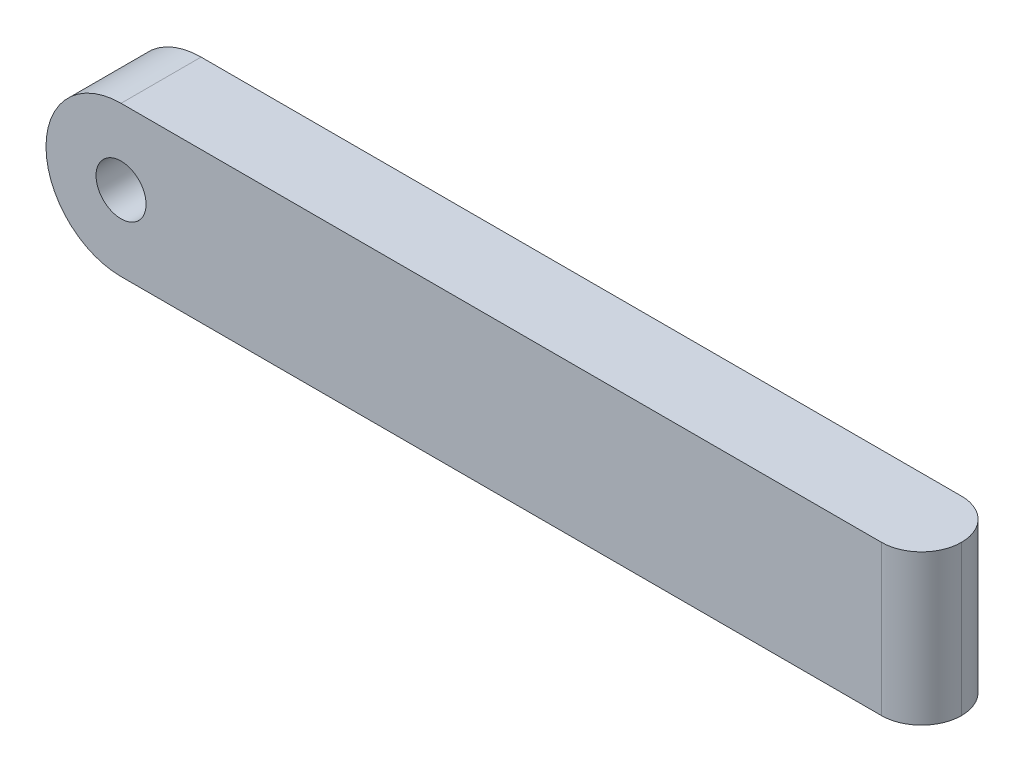
ISO-10303-21;
HEADER;
FILE_DESCRIPTION(('STEP AP214'),'2;1');
FILE_NAME('part.step','',(''),(''),'','','');
FILE_SCHEMA(('AUTOMOTIVE_DESIGN { 1 0 10303 214 1 1 1 1 }'));
ENDSEC;
DATA;
#1=APPLICATION_CONTEXT('core data for automotive mechanical design processes');
#2=APPLICATION_PROTOCOL_DEFINITION('international standard','automotive_design',2000,#1);
#3=PRODUCT_CONTEXT('',#1,'mechanical');
#4=PRODUCT('Part','Part','',(#3));
#5=PRODUCT_RELATED_PRODUCT_CATEGORY('part','',(#4));
#6=PRODUCT_DEFINITION_FORMATION('','',#4);
#7=PRODUCT_DEFINITION_CONTEXT('part definition',#1,'design');
#8=PRODUCT_DEFINITION('design','',#6,#7);
#9=PRODUCT_DEFINITION_SHAPE('','',#8);
#10=(LENGTH_UNIT() NAMED_UNIT(*) SI_UNIT(.MILLI.,.METRE.));
#11=(NAMED_UNIT(*) PLANE_ANGLE_UNIT() SI_UNIT($,.RADIAN.));
#12=(NAMED_UNIT(*) SI_UNIT($,.STERADIAN.) SOLID_ANGLE_UNIT());
#13=UNCERTAINTY_MEASURE_WITH_UNIT(LENGTH_MEASURE(1.E-05),#10,'distance_accuracy_value','');
#14=(GEOMETRIC_REPRESENTATION_CONTEXT(3) GLOBAL_UNCERTAINTY_ASSIGNED_CONTEXT((#13)) GLOBAL_UNIT_ASSIGNED_CONTEXT((#10,
#11,#12)) REPRESENTATION_CONTEXT('',''));
#15=CARTESIAN_POINT('',(0.,0.,0.));
#16=DIRECTION('',(0.,0.,1.));
#17=DIRECTION('',(1.,0.,0.));
#18=AXIS2_PLACEMENT_3D('',#15,#16,#17);
#19=CARTESIAN_POINT('',(0.,0.,8.));
#20=DIRECTION('',(0.,0.,1.));
#21=DIRECTION('',(1.,0.,0.));
#22=AXIS2_PLACEMENT_3D('',#19,#20,#21);
#23=PLANE('',#22);
#24=DIRECTION('',(1.,0.,0.));
#25=VECTOR('',#24,1.);
#26=CARTESIAN_POINT('',(0.,-7.5,8.));
#27=LINE('',#26,#25);
#28=CARTESIAN_POINT('',(0.,-7.5,8.));
#29=VERTEX_POINT('',#28);
#30=CARTESIAN_POINT('',(76.,-7.5,8.));
#31=VERTEX_POINT('',#30);
#32=EDGE_CURVE('E79',#29,#31,#27,.T.);
#33=ORIENTED_EDGE('',*,*,#32,.T.);
#34=DIRECTION('',(0.,1.,0.));
#35=VECTOR('',#34,1.);
#36=CARTESIAN_POINT('',(76.,7.5,8.));
#37=LINE('',#36,#35);
#38=CARTESIAN_POINT('',(76.,7.5,8.));
#39=VERTEX_POINT('',#38);
#40=EDGE_CURVE('E11',#31,#39,#37,.T.);
#41=ORIENTED_EDGE('',*,*,#40,.T.);
#42=DIRECTION('',(-1.,0.,0.));
#43=VECTOR('',#42,1.);
#44=CARTESIAN_POINT('',(0.,7.5,8.));
#45=LINE('',#44,#43);
#46=CARTESIAN_POINT('',(0.,7.5,8.));
#47=VERTEX_POINT('',#46);
#48=EDGE_CURVE('E87',#39,#47,#45,.T.);
#49=ORIENTED_EDGE('',*,*,#48,.T.);
#50=CARTESIAN_POINT('',(0.,0.,8.));
#51=DIRECTION('',(0.,0.,1.));
#52=DIRECTION('',(1.,0.,0.));
#53=AXIS2_PLACEMENT_3D('',#50,#51,#52);
#54=CIRCLE('',#53,7.5);
#55=EDGE_CURVE('E88',#47,#29,#54,.T.);
#56=ORIENTED_EDGE('',*,*,#55,.T.);
#57=EDGE_LOOP('',(#33,#41,#49,#56));
#58=FACE_BOUND('',#57,.T.);
#59=CARTESIAN_POINT('',(0.,0.,8.));
#60=DIRECTION('',(0.,0.,1.));
#61=DIRECTION('',(1.,0.,0.));
#62=AXIS2_PLACEMENT_3D('',#59,#60,#61);
#63=CIRCLE('',#62,2.5);
#64=CARTESIAN_POINT('',(2.5,0.,8.));
#65=VERTEX_POINT('',#64);
#66=EDGE_CURVE('E123',#65,#65,#63,.T.);
#67=ORIENTED_EDGE('',*,*,#66,.F.);
#68=EDGE_LOOP('',(#67));
#69=FACE_BOUND('',#68,.T.);
#70=ADVANCED_FACE('F37',(#58,#69),#23,.T.);
#71=CARTESIAN_POINT('',(0.,0.,0.));
#72=DIRECTION('',(0.,0.,1.));
#73=DIRECTION('',(1.,0.,0.));
#74=AXIS2_PLACEMENT_3D('',#71,#72,#73);
#75=PLANE('',#74);
#76=DIRECTION('',(-1.,0.,0.));
#77=VECTOR('',#76,1.);
#78=CARTESIAN_POINT('',(0.,7.5,0.));
#79=LINE('',#78,#77);
#80=CARTESIAN_POINT('',(76.,7.5,0.));
#81=VERTEX_POINT('',#80);
#82=CARTESIAN_POINT('',(0.,7.5,0.));
#83=VERTEX_POINT('',#82);
#84=EDGE_CURVE('E96',#81,#83,#79,.T.);
#85=ORIENTED_EDGE('',*,*,#84,.F.);
#86=DIRECTION('',(0.,1.,0.));
#87=VECTOR('',#86,1.);
#88=CARTESIAN_POINT('',(76.,0.,0.));
#89=LINE('',#88,#87);
#90=CARTESIAN_POINT('',(76.,-7.5,0.));
#91=VERTEX_POINT('',#90);
#92=EDGE_CURVE('E110',#81,#91,#89,.F.);
#93=ORIENTED_EDGE('',*,*,#92,.T.);
#94=DIRECTION('',(1.,0.,0.));
#95=VECTOR('',#94,1.);
#96=CARTESIAN_POINT('',(0.,-7.5,0.));
#97=LINE('',#96,#95);
#98=CARTESIAN_POINT('',(0.,-7.5,0.));
#99=VERTEX_POINT('',#98);
#100=EDGE_CURVE('E119',#99,#91,#97,.T.);
#101=ORIENTED_EDGE('',*,*,#100,.F.);
#102=CARTESIAN_POINT('',(0.,0.,0.));
#103=DIRECTION('',(0.,0.,1.));
#104=DIRECTION('',(1.,0.,0.));
#105=AXIS2_PLACEMENT_3D('',#102,#103,#104);
#106=CIRCLE('',#105,7.5);
#107=EDGE_CURVE('E100',#83,#99,#106,.T.);
#108=ORIENTED_EDGE('',*,*,#107,.F.);
#109=EDGE_LOOP('',(#85,#93,#101,#108));
#110=FACE_BOUND('',#109,.T.);
#111=CARTESIAN_POINT('',(0.,0.,0.));
#112=DIRECTION('',(0.,0.,1.));
#113=DIRECTION('',(1.,0.,0.));
#114=AXIS2_PLACEMENT_3D('',#111,#112,#113);
#115=CIRCLE('',#114,2.5);
#116=CARTESIAN_POINT('',(2.5,0.,0.));
#117=VERTEX_POINT('',#116);
#118=EDGE_CURVE('E127',#117,#117,#115,.T.);
#119=ORIENTED_EDGE('',*,*,#118,.T.);
#120=EDGE_LOOP('',(#119));
#121=FACE_BOUND('',#120,.T.);
#122=ADVANCED_FACE('F117',(#110,#121),#75,.F.);
#123=CARTESIAN_POINT('',(0.,0.,8.));
#124=DIRECTION('',(0.,0.,-1.));
#125=DIRECTION('',(-1.,0.,0.));
#126=AXIS2_PLACEMENT_3D('',#123,#124,#125);
#127=CYLINDRICAL_SURFACE('',#126,7.5);
#128=ORIENTED_EDGE('',*,*,#107,.T.);
#129=DIRECTION('',(0.,0.,-1.));
#130=VECTOR('',#129,1.);
#131=CARTESIAN_POINT('',(0.,-7.5,8.));
#132=LINE('',#131,#130);
#133=EDGE_CURVE('E83',#29,#99,#132,.T.);
#134=ORIENTED_EDGE('',*,*,#133,.F.);
#135=ORIENTED_EDGE('',*,*,#55,.F.);
#136=DIRECTION('',(0.,0.,-1.));
#137=VECTOR('',#136,1.);
#138=CARTESIAN_POINT('',(0.,7.5,8.));
#139=LINE('',#138,#137);
#140=EDGE_CURVE('E102',#47,#83,#139,.T.);
#141=ORIENTED_EDGE('',*,*,#140,.T.);
#142=EDGE_LOOP('',(#128,#134,#135,#141));
#143=FACE_BOUND('',#142,.T.);
#144=ADVANCED_FACE('F98',(#143),#127,.T.);
#145=CARTESIAN_POINT('',(0.,-7.5,8.));
#146=DIRECTION('',(0.,1.,0.));
#147=DIRECTION('',(0.,0.,1.));
#148=AXIS2_PLACEMENT_3D('',#145,#146,#147);
#149=PLANE('',#148);
#150=ORIENTED_EDGE('',*,*,#100,.T.);
#151=CARTESIAN_POINT('',(76.,-7.5,4.));
#152=DIRECTION('',(0.,1.,0.));
#153=DIRECTION('',(0.,0.,1.));
#154=AXIS2_PLACEMENT_3D('',#151,#152,#153);
#155=CIRCLE('',#154,4.);
#156=CARTESIAN_POINT('',(80.,-7.5,4.));
#157=VERTEX_POINT('',#156);
#158=EDGE_CURVE('E46',#91,#157,#155,.F.);
#159=ORIENTED_EDGE('',*,*,#158,.T.);
#160=CARTESIAN_POINT('',(76.,-7.5,4.));
#161=DIRECTION('',(0.,1.,0.));
#162=DIRECTION('',(0.,0.,1.));
#163=AXIS2_PLACEMENT_3D('',#160,#161,#162);
#164=CIRCLE('',#163,4.);
#165=EDGE_CURVE('E53',#157,#31,#164,.F.);
#166=ORIENTED_EDGE('',*,*,#165,.T.);
#167=ORIENTED_EDGE('',*,*,#32,.F.);
#168=ORIENTED_EDGE('',*,*,#133,.T.);
#169=EDGE_LOOP('',(#150,#159,#166,#167,#168));
#170=FACE_BOUND('',#169,.T.);
#171=ADVANCED_FACE('F81',(#170),#149,.F.);
#172=CARTESIAN_POINT('',(0.,7.5,8.));
#173=DIRECTION('',(0.,-1.,0.));
#174=DIRECTION('',(0.,0.,-1.));
#175=AXIS2_PLACEMENT_3D('',#172,#173,#174);
#176=PLANE('',#175);
#177=CARTESIAN_POINT('',(76.,7.5,4.));
#178=DIRECTION('',(0.,-1.,0.));
#179=DIRECTION('',(0.,0.,-1.));
#180=AXIS2_PLACEMENT_3D('',#177,#178,#179);
#181=CIRCLE('',#180,4.);
#182=CARTESIAN_POINT('',(80.,7.5,4.));
#183=VERTEX_POINT('',#182);
#184=EDGE_CURVE('E101',#39,#183,#181,.F.);
#185=ORIENTED_EDGE('',*,*,#184,.T.);
#186=CARTESIAN_POINT('',(76.,7.5,4.));
#187=DIRECTION('',(0.,-1.,0.));
#188=DIRECTION('',(0.,0.,-1.));
#189=AXIS2_PLACEMENT_3D('',#186,#187,#188);
#190=CIRCLE('',#189,4.);
#191=EDGE_CURVE('E104',#183,#81,#190,.F.);
#192=ORIENTED_EDGE('',*,*,#191,.T.);
#193=ORIENTED_EDGE('',*,*,#84,.T.);
#194=ORIENTED_EDGE('',*,*,#140,.F.);
#195=ORIENTED_EDGE('',*,*,#48,.F.);
#196=EDGE_LOOP('',(#185,#192,#193,#194,#195));
#197=FACE_BOUND('',#196,.T.);
#198=ADVANCED_FACE('F143',(#197),#176,.F.);
#199=CARTESIAN_POINT('',(0.,0.,8.));
#200=DIRECTION('',(0.,0.,-1.));
#201=DIRECTION('',(-1.,0.,0.));
#202=AXIS2_PLACEMENT_3D('',#199,#200,#201);
#203=CYLINDRICAL_SURFACE('',#202,2.5);
#204=ORIENTED_EDGE('',*,*,#66,.T.);
#205=EDGE_LOOP('',(#204));
#206=FACE_BOUND('',#205,.T.);
#207=ORIENTED_EDGE('',*,*,#118,.F.);
#208=EDGE_LOOP('',(#207));
#209=FACE_BOUND('',#208,.T.);
#210=ADVANCED_FACE('F133',(#206,#209),#203,.F.);
#211=CARTESIAN_POINT('',(76.,0.,4.));
#212=DIRECTION('',(0.,-1.,0.));
#213=DIRECTION('',(0.,0.,-1.));
#214=AXIS2_PLACEMENT_3D('',#211,#212,#213);
#215=CYLINDRICAL_SURFACE('',#214,4.);
#216=ORIENTED_EDGE('',*,*,#40,.F.);
#217=ORIENTED_EDGE('',*,*,#165,.F.);
#218=DIRECTION('',(0.,1.,0.));
#219=VECTOR('',#218,1.);
#220=CARTESIAN_POINT('',(80.,-7.5,4.));
#221=LINE('',#220,#219);
#222=EDGE_CURVE('E41',#183,#157,#221,.F.);
#223=ORIENTED_EDGE('',*,*,#222,.F.);
#224=ORIENTED_EDGE('',*,*,#184,.F.);
#225=EDGE_LOOP('',(#216,#217,#223,#224));
#226=FACE_BOUND('',#225,.T.);
#227=ADVANCED_FACE('F39',(#226),#215,.T.);
#228=CARTESIAN_POINT('',(76.,7.5,4.));
#229=DIRECTION('',(0.,1.,0.));
#230=DIRECTION('',(0.,0.,1.));
#231=AXIS2_PLACEMENT_3D('',#228,#229,#230);
#232=CYLINDRICAL_SURFACE('',#231,4.);
#233=ORIENTED_EDGE('',*,*,#158,.F.);
#234=ORIENTED_EDGE('',*,*,#92,.F.);
#235=ORIENTED_EDGE('',*,*,#191,.F.);
#236=ORIENTED_EDGE('',*,*,#222,.T.);
#237=EDGE_LOOP('',(#233,#234,#235,#236));
#238=FACE_BOUND('',#237,.T.);
#239=ADVANCED_FACE('F150',(#238),#232,.T.);
#240=CLOSED_SHELL('',(#70,#122,#144,#171,#198,#210,#227,#239));
#241=MANIFOLD_SOLID_BREP('B2',#240);
#242=ADVANCED_BREP_SHAPE_REPRESENTATION('',(#18,#241),#14);
#243=SHAPE_DEFINITION_REPRESENTATION(#9,#242);
ENDSEC;
END-ISO-10303-21;
